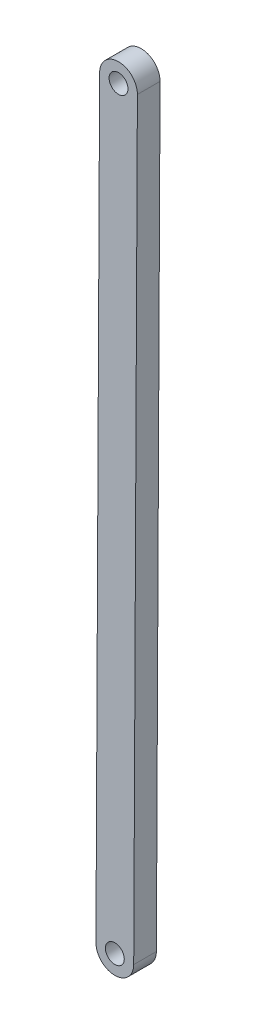
ISO-10303-21;
HEADER;
FILE_DESCRIPTION(('STEP AP214'),'2;1');
FILE_NAME('part.step','',(''),(''),'','','');
FILE_SCHEMA(('AUTOMOTIVE_DESIGN { 1 0 10303 214 1 1 1 1 }'));
ENDSEC;
DATA;
#1=APPLICATION_CONTEXT('core data for automotive mechanical design processes');
#2=APPLICATION_PROTOCOL_DEFINITION('international standard','automotive_design',2000,#1);
#3=PRODUCT_CONTEXT('',#1,'mechanical');
#4=PRODUCT('Part','Part','',(#3));
#5=PRODUCT_RELATED_PRODUCT_CATEGORY('part','',(#4));
#6=PRODUCT_DEFINITION_FORMATION('','',#4);
#7=PRODUCT_DEFINITION_CONTEXT('part definition',#1,'design');
#8=PRODUCT_DEFINITION('design','',#6,#7);
#9=PRODUCT_DEFINITION_SHAPE('','',#8);
#10=(LENGTH_UNIT() NAMED_UNIT(*) SI_UNIT(.MILLI.,.METRE.));
#11=(NAMED_UNIT(*) PLANE_ANGLE_UNIT() SI_UNIT($,.RADIAN.));
#12=(NAMED_UNIT(*) SI_UNIT($,.STERADIAN.) SOLID_ANGLE_UNIT());
#13=UNCERTAINTY_MEASURE_WITH_UNIT(LENGTH_MEASURE(1.E-05),#10,'distance_accuracy_value','');
#14=(GEOMETRIC_REPRESENTATION_CONTEXT(3) GLOBAL_UNCERTAINTY_ASSIGNED_CONTEXT((#13)) GLOBAL_UNIT_ASSIGNED_CONTEXT((#10,
#11,#12)) REPRESENTATION_CONTEXT('',''));
#15=CARTESIAN_POINT('',(0.,0.,0.));
#16=DIRECTION('',(0.,0.,1.));
#17=DIRECTION('',(1.,0.,0.));
#18=AXIS2_PLACEMENT_3D('',#15,#16,#17);
#19=CARTESIAN_POINT('',(0.,0.,6.));
#20=DIRECTION('',(0.,0.,1.));
#21=DIRECTION('',(1.,0.,0.));
#22=AXIS2_PLACEMENT_3D('',#19,#20,#21);
#23=PLANE('',#22);
#24=CARTESIAN_POINT('',(-1.94916067146284,-400.,6.));
#25=DIRECTION('',(0.,0.,1.));
#26=DIRECTION('',(1.,0.,0.));
#27=AXIS2_PLACEMENT_3D('',#24,#25,#26);
#28=CIRCLE('',#27,5.);
#29=CARTESIAN_POINT('',(3.05083932853717,-400.,6.));
#30=VERTEX_POINT('',#29);
#31=EDGE_CURVE('E103',#30,#30,#28,.T.);
#32=ORIENTED_EDGE('',*,*,#31,.F.);
#33=EDGE_LOOP('',(#32));
#34=FACE_BOUND('',#33,.T.);
#35=CARTESIAN_POINT('',(0.,0.,6.));
#36=DIRECTION('',(0.,0.,1.));
#37=DIRECTION('',(1.,0.,0.));
#38=AXIS2_PLACEMENT_3D('',#35,#36,#37);
#39=CIRCLE('',#38,10.);
#40=CARTESIAN_POINT('',(9.9998812762605,-0.0487284382574613,6.));
#41=VERTEX_POINT('',#40);
#42=CARTESIAN_POINT('',(-9.9998812762605,0.0487284382574613,6.));
#43=VERTEX_POINT('',#42);
#44=EDGE_CURVE('E78',#41,#43,#39,.T.);
#45=ORIENTED_EDGE('',*,*,#44,.T.);
#46=DIRECTION('',(-0.00487284382574612,-0.999988127626048,0.));
#47=VECTOR('',#46,1.);
#48=CARTESIAN_POINT('',(-9.9998812762605,0.0487284382574613,6.));
#49=LINE('',#48,#47);
#50=CARTESIAN_POINT('',(-11.9490419477233,-399.951271561743,6.));
#51=VERTEX_POINT('',#50);
#52=EDGE_CURVE('E107',#43,#51,#49,.T.);
#53=ORIENTED_EDGE('',*,*,#52,.T.);
#54=CARTESIAN_POINT('',(-1.94916067146284,-400.,6.));
#55=DIRECTION('',(0.,0.,1.));
#56=DIRECTION('',(1.,0.,0.));
#57=AXIS2_PLACEMENT_3D('',#54,#55,#56);
#58=CIRCLE('',#57,10.);
#59=CARTESIAN_POINT('',(8.05072060479766,-400.048728438258,6.));
#60=VERTEX_POINT('',#59);
#61=EDGE_CURVE('E53',#51,#60,#58,.T.);
#62=ORIENTED_EDGE('',*,*,#61,.T.);
#63=DIRECTION('',(0.00487284382574613,0.999988127626048,0.));
#64=VECTOR('',#63,1.);
#65=CARTESIAN_POINT('',(9.9998812762605,-0.0487284382574613,6.));
#66=LINE('',#65,#64);
#67=EDGE_CURVE('E48',#60,#41,#66,.T.);
#68=ORIENTED_EDGE('',*,*,#67,.T.);
#69=EDGE_LOOP('',(#45,#53,#62,#68));
#70=FACE_BOUND('',#69,.T.);
#71=CARTESIAN_POINT('',(0.,0.,6.));
#72=DIRECTION('',(0.,0.,1.));
#73=DIRECTION('',(1.,0.,0.));
#74=AXIS2_PLACEMENT_3D('',#71,#72,#73);
#75=CIRCLE('',#74,5.);
#76=CARTESIAN_POINT('',(5.,0.,6.));
#77=VERTEX_POINT('',#76);
#78=EDGE_CURVE('E100',#77,#77,#75,.T.);
#79=ORIENTED_EDGE('',*,*,#78,.F.);
#80=EDGE_LOOP('',(#79));
#81=FACE_BOUND('',#80,.T.);
#82=ADVANCED_FACE('F33',(#34,#70,#81),#23,.T.);
#83=CARTESIAN_POINT('',(0.,0.,6.));
#84=DIRECTION('',(0.,0.,-1.));
#85=DIRECTION('',(-1.,0.,0.));
#86=AXIS2_PLACEMENT_3D('',#83,#84,#85);
#87=CYLINDRICAL_SURFACE('',#86,10.);
#88=DIRECTION('',(0.,0.,-1.));
#89=VECTOR('',#88,1.);
#90=CARTESIAN_POINT('',(9.9998812762605,-0.0487284382574613,6.));
#91=LINE('',#90,#89);
#92=CARTESIAN_POINT('',(9.9998812762605,-0.0487284382574613,-6.));
#93=VERTEX_POINT('',#92);
#94=EDGE_CURVE('E73',#41,#93,#91,.T.);
#95=ORIENTED_EDGE('',*,*,#94,.T.);
#96=CARTESIAN_POINT('',(0.,0.,-6.));
#97=DIRECTION('',(0.,0.,1.));
#98=DIRECTION('',(1.,0.,0.));
#99=AXIS2_PLACEMENT_3D('',#96,#97,#98);
#100=CIRCLE('',#99,10.);
#101=CARTESIAN_POINT('',(-9.9998812762605,0.0487284382574613,-6.));
#102=VERTEX_POINT('',#101);
#103=EDGE_CURVE('E76',#93,#102,#100,.T.);
#104=ORIENTED_EDGE('',*,*,#103,.T.);
#105=DIRECTION('',(0.,0.,-1.));
#106=VECTOR('',#105,1.);
#107=CARTESIAN_POINT('',(-9.9998812762605,0.0487284382574613,6.));
#108=LINE('',#107,#106);
#109=EDGE_CURVE('E11',#43,#102,#108,.T.);
#110=ORIENTED_EDGE('',*,*,#109,.F.);
#111=ORIENTED_EDGE('',*,*,#44,.F.);
#112=EDGE_LOOP('',(#95,#104,#110,#111));
#113=FACE_BOUND('',#112,.T.);
#114=ADVANCED_FACE('F35',(#113),#87,.T.);
#115=CARTESIAN_POINT('',(-9.9998812762605,0.0487284382574613,6.));
#116=DIRECTION('',(0.999988127626048,-0.00487284382574612,0.));
#117=DIRECTION('',(0.00487284382574612,0.999988127626048,0.));
#118=AXIS2_PLACEMENT_3D('',#115,#116,#117);
#119=PLANE('',#118);
#120=ORIENTED_EDGE('',*,*,#109,.T.);
#121=DIRECTION('',(-0.00487284382574612,-0.999988127626048,0.));
#122=VECTOR('',#121,1.);
#123=CARTESIAN_POINT('',(-9.9998812762605,0.0487284382574613,-6.));
#124=LINE('',#123,#122);
#125=CARTESIAN_POINT('',(-11.9490419477233,-399.951271561743,-6.));
#126=VERTEX_POINT('',#125);
#127=EDGE_CURVE('E90',#102,#126,#124,.T.);
#128=ORIENTED_EDGE('',*,*,#127,.T.);
#129=DIRECTION('',(0.,0.,-1.));
#130=VECTOR('',#129,1.);
#131=CARTESIAN_POINT('',(-11.9490419477233,-399.951271561743,6.));
#132=LINE('',#131,#130);
#133=EDGE_CURVE('E41',#51,#126,#132,.T.);
#134=ORIENTED_EDGE('',*,*,#133,.F.);
#135=ORIENTED_EDGE('',*,*,#52,.F.);
#136=EDGE_LOOP('',(#120,#128,#134,#135));
#137=FACE_BOUND('',#136,.T.);
#138=ADVANCED_FACE('F115',(#137),#119,.F.);
#139=CARTESIAN_POINT('',(-1.94916067146284,-400.,6.));
#140=DIRECTION('',(0.,0.,-1.));
#141=DIRECTION('',(-1.,0.,0.));
#142=AXIS2_PLACEMENT_3D('',#139,#140,#141);
#143=CYLINDRICAL_SURFACE('',#142,10.);
#144=ORIENTED_EDGE('',*,*,#133,.T.);
#145=CARTESIAN_POINT('',(-1.94916067146284,-400.,-6.));
#146=DIRECTION('',(0.,0.,1.));
#147=DIRECTION('',(1.,0.,0.));
#148=AXIS2_PLACEMENT_3D('',#145,#146,#147);
#149=CIRCLE('',#148,10.);
#150=CARTESIAN_POINT('',(8.05072060479766,-400.048728438258,-6.));
#151=VERTEX_POINT('',#150);
#152=EDGE_CURVE('E94',#126,#151,#149,.T.);
#153=ORIENTED_EDGE('',*,*,#152,.T.);
#154=DIRECTION('',(0.,0.,-1.));
#155=VECTOR('',#154,1.);
#156=CARTESIAN_POINT('',(8.05072060479766,-400.048728438258,6.));
#157=LINE('',#156,#155);
#158=EDGE_CURVE('E81',#60,#151,#157,.T.);
#159=ORIENTED_EDGE('',*,*,#158,.F.);
#160=ORIENTED_EDGE('',*,*,#61,.F.);
#161=EDGE_LOOP('',(#144,#153,#159,#160));
#162=FACE_BOUND('',#161,.T.);
#163=ADVANCED_FACE('F113',(#162),#143,.T.);
#164=CARTESIAN_POINT('',(9.9998812762605,-0.0487284382574613,6.));
#165=DIRECTION('',(-0.999988127626048,0.00487284382574613,0.));
#166=DIRECTION('',(-0.00487284382574613,-0.999988127626048,0.));
#167=AXIS2_PLACEMENT_3D('',#164,#165,#166);
#168=PLANE('',#167);
#169=ORIENTED_EDGE('',*,*,#158,.T.);
#170=DIRECTION('',(0.00487284382574613,0.999988127626048,0.));
#171=VECTOR('',#170,1.);
#172=CARTESIAN_POINT('',(9.9998812762605,-0.0487284382574613,-6.));
#173=LINE('',#172,#171);
#174=EDGE_CURVE('E87',#151,#93,#173,.T.);
#175=ORIENTED_EDGE('',*,*,#174,.T.);
#176=ORIENTED_EDGE('',*,*,#94,.F.);
#177=ORIENTED_EDGE('',*,*,#67,.F.);
#178=EDGE_LOOP('',(#169,#175,#176,#177));
#179=FACE_BOUND('',#178,.T.);
#180=ADVANCED_FACE('F93',(#179),#168,.F.);
#181=CARTESIAN_POINT('',(-1.94916067146284,-400.,6.));
#182=DIRECTION('',(0.,0.,-1.));
#183=DIRECTION('',(-1.,0.,0.));
#184=AXIS2_PLACEMENT_3D('',#181,#182,#183);
#185=CYLINDRICAL_SURFACE('',#184,5.);
#186=ORIENTED_EDGE('',*,*,#31,.T.);
#187=EDGE_LOOP('',(#186));
#188=FACE_BOUND('',#187,.T.);
#189=CARTESIAN_POINT('',(-1.94916067146284,-400.,-6.));
#190=DIRECTION('',(0.,0.,1.));
#191=DIRECTION('',(1.,0.,0.));
#192=AXIS2_PLACEMENT_3D('',#189,#190,#191);
#193=CIRCLE('',#192,5.);
#194=CARTESIAN_POINT('',(3.05083932853717,-400.,-6.));
#195=VERTEX_POINT('',#194);
#196=EDGE_CURVE('E91',#195,#195,#193,.T.);
#197=ORIENTED_EDGE('',*,*,#196,.F.);
#198=EDGE_LOOP('',(#197));
#199=FACE_BOUND('',#198,.T.);
#200=ADVANCED_FACE('F125',(#188,#199),#185,.F.);
#201=CARTESIAN_POINT('',(0.,0.,6.));
#202=DIRECTION('',(0.,0.,-1.));
#203=DIRECTION('',(-1.,0.,0.));
#204=AXIS2_PLACEMENT_3D('',#201,#202,#203);
#205=CYLINDRICAL_SURFACE('',#204,5.);
#206=ORIENTED_EDGE('',*,*,#78,.T.);
#207=EDGE_LOOP('',(#206));
#208=FACE_BOUND('',#207,.T.);
#209=CARTESIAN_POINT('',(0.,0.,-6.));
#210=DIRECTION('',(0.,0.,1.));
#211=DIRECTION('',(1.,0.,0.));
#212=AXIS2_PLACEMENT_3D('',#209,#210,#211);
#213=CIRCLE('',#212,5.);
#214=CARTESIAN_POINT('',(5.,0.,-6.));
#215=VERTEX_POINT('',#214);
#216=EDGE_CURVE('E129',#215,#215,#213,.T.);
#217=ORIENTED_EDGE('',*,*,#216,.F.);
#218=EDGE_LOOP('',(#217));
#219=FACE_BOUND('',#218,.T.);
#220=ADVANCED_FACE('F122',(#208,#219),#205,.F.);
#221=CARTESIAN_POINT('',(0.,0.,-6.));
#222=DIRECTION('',(0.,0.,-1.));
#223=DIRECTION('',(1.,0.,0.));
#224=AXIS2_PLACEMENT_3D('',#221,#222,#223);
#225=PLANE('',#224);
#226=ORIENTED_EDGE('',*,*,#216,.T.);
#227=EDGE_LOOP('',(#226));
#228=FACE_BOUND('',#227,.T.);
#229=ORIENTED_EDGE('',*,*,#196,.T.);
#230=EDGE_LOOP('',(#229));
#231=FACE_BOUND('',#230,.T.);
#232=ORIENTED_EDGE('',*,*,#103,.F.);
#233=ORIENTED_EDGE('',*,*,#174,.F.);
#234=ORIENTED_EDGE('',*,*,#152,.F.);
#235=ORIENTED_EDGE('',*,*,#127,.F.);
#236=EDGE_LOOP('',(#232,#233,#234,#235));
#237=FACE_BOUND('',#236,.T.);
#238=ADVANCED_FACE('F85',(#228,#231,#237),#225,.T.);
#239=CLOSED_SHELL('',(#82,#114,#138,#163,#180,#200,#220,#238));
#240=MANIFOLD_SOLID_BREP('B2',#239);
#241=ADVANCED_BREP_SHAPE_REPRESENTATION('',(#18,#240),#14);
#242=SHAPE_DEFINITION_REPRESENTATION(#9,#241);
ENDSEC;
END-ISO-10303-21;
